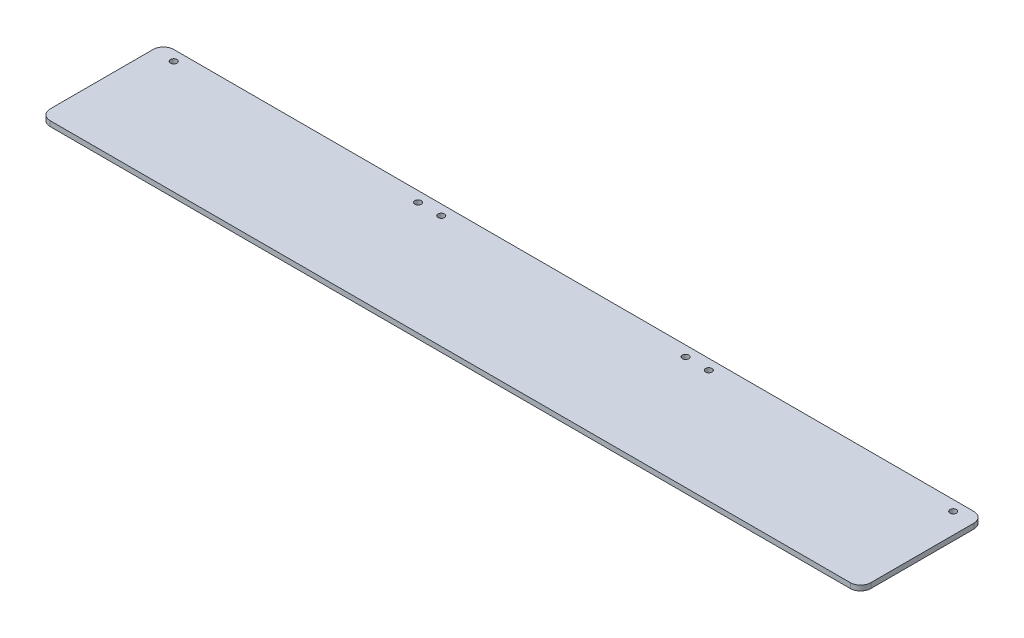
ISO-10303-21;
HEADER;
FILE_DESCRIPTION(('STEP AP214'),'2;1');
FILE_NAME('part.step','',(''),(''),'','','');
FILE_SCHEMA(('AUTOMOTIVE_DESIGN { 1 0 10303 214 1 1 1 1 }'));
ENDSEC;
DATA;
#1=APPLICATION_CONTEXT('core data for automotive mechanical design processes');
#2=APPLICATION_PROTOCOL_DEFINITION('international standard','automotive_design',2000,#1);
#3=PRODUCT_CONTEXT('',#1,'mechanical');
#4=PRODUCT('Part','Part','',(#3));
#5=PRODUCT_RELATED_PRODUCT_CATEGORY('part','',(#4));
#6=PRODUCT_DEFINITION_FORMATION('','',#4);
#7=PRODUCT_DEFINITION_CONTEXT('part definition',#1,'design');
#8=PRODUCT_DEFINITION('design','',#6,#7);
#9=PRODUCT_DEFINITION_SHAPE('','',#8);
#10=(LENGTH_UNIT() NAMED_UNIT(*) SI_UNIT(.MILLI.,.METRE.));
#11=(NAMED_UNIT(*) PLANE_ANGLE_UNIT() SI_UNIT($,.RADIAN.));
#12=(NAMED_UNIT(*) SI_UNIT($,.STERADIAN.) SOLID_ANGLE_UNIT());
#13=UNCERTAINTY_MEASURE_WITH_UNIT(LENGTH_MEASURE(1.E-05),#10,'distance_accuracy_value','');
#14=(GEOMETRIC_REPRESENTATION_CONTEXT(3) GLOBAL_UNCERTAINTY_ASSIGNED_CONTEXT((#13)) GLOBAL_UNIT_ASSIGNED_CONTEXT((#10,
#11,#12)) REPRESENTATION_CONTEXT('',''));
#15=CARTESIAN_POINT('',(0.,0.,0.));
#16=DIRECTION('',(0.,0.,1.));
#17=DIRECTION('',(1.,0.,0.));
#18=AXIS2_PLACEMENT_3D('',#15,#16,#17);
#19=CARTESIAN_POINT('',(2000.25000000001,12.7,-25.4));
#20=DIRECTION('',(0.,-1.,0.));
#21=DIRECTION('',(0.,0.,-1.));
#22=AXIS2_PLACEMENT_3D('',#19,#20,#21);
#23=PLANE('',#22);
#24=CARTESIAN_POINT('',(2000.25000000001,12.7,-25.4));
#25=DIRECTION('',(0.,1.,0.));
#26=DIRECTION('',(0.,0.,-1.));
#27=AXIS2_PLACEMENT_3D('',#24,#25,#26);
#28=CIRCLE('',#27,25.3999999999999);
#29=CARTESIAN_POINT('',(2000.25000000001,12.7,0.));
#30=VERTEX_POINT('',#29);
#31=CARTESIAN_POINT('',(2025.65000000001,12.7,-25.4));
#32=VERTEX_POINT('',#31);
#33=EDGE_CURVE('E149',#30,#32,#28,.T.);
#34=ORIENTED_EDGE('',*,*,#33,.T.);
#35=DIRECTION('',(0.,0.,-1.));
#36=VECTOR('',#35,1.);
#37=CARTESIAN_POINT('',(2025.65000000001,12.7,-25.4));
#38=LINE('',#37,#36);
#39=CARTESIAN_POINT('',(2025.65000000001,12.7,-279.4));
#40=VERTEX_POINT('',#39);
#41=EDGE_CURVE('E97',#32,#40,#38,.T.);
#42=ORIENTED_EDGE('',*,*,#41,.T.);
#43=CARTESIAN_POINT('',(2000.25000000001,12.7,-279.4));
#44=DIRECTION('',(0.,1.,0.));
#45=DIRECTION('',(0.,0.,-1.));
#46=AXIS2_PLACEMENT_3D('',#43,#44,#45);
#47=CIRCLE('',#46,25.3999999999999);
#48=CARTESIAN_POINT('',(2000.25000000001,12.7,-304.8));
#49=VERTEX_POINT('',#48);
#50=EDGE_CURVE('E164',#40,#49,#47,.T.);
#51=ORIENTED_EDGE('',*,*,#50,.T.);
#52=DIRECTION('',(-1.,0.,0.));
#53=VECTOR('',#52,1.);
#54=CARTESIAN_POINT('',(25.3999999999996,12.7,-304.800000000007));
#55=LINE('',#54,#53);
#56=CARTESIAN_POINT('',(25.3999999999996,12.7,-304.800000000007));
#57=VERTEX_POINT('',#56);
#58=EDGE_CURVE('E177',#49,#57,#55,.T.);
#59=ORIENTED_EDGE('',*,*,#58,.T.);
#60=CARTESIAN_POINT('',(25.4,12.7,-279.40000000002));
#61=DIRECTION('',(0.,1.,0.));
#62=DIRECTION('',(0.,0.,-1.));
#63=AXIS2_PLACEMENT_3D('',#60,#61,#62);
#64=CIRCLE('',#63,25.3999999999933);
#65=CARTESIAN_POINT('',(6.6717464886068E-12,12.7,-279.400000000007));
#66=VERTEX_POINT('',#65);
#67=EDGE_CURVE('E116',#57,#66,#64,.T.);
#68=ORIENTED_EDGE('',*,*,#67,.T.);
#69=DIRECTION('',(0.,0.,1.));
#70=VECTOR('',#69,1.);
#71=CARTESIAN_POINT('',(0.,12.7,-25.4000000000002));
#72=LINE('',#71,#70);
#73=CARTESIAN_POINT('',(0.,12.7,-25.4000000000002));
#74=VERTEX_POINT('',#73);
#75=EDGE_CURVE('E110',#66,#74,#72,.T.);
#76=ORIENTED_EDGE('',*,*,#75,.T.);
#77=CARTESIAN_POINT('',(25.4,12.7,-25.4));
#78=DIRECTION('',(0.,1.,0.));
#79=DIRECTION('',(0.,0.,1.));
#80=AXIS2_PLACEMENT_3D('',#77,#78,#79);
#81=CIRCLE('',#80,25.4);
#82=CARTESIAN_POINT('',(25.4,12.7,0.));
#83=VERTEX_POINT('',#82);
#84=EDGE_CURVE('E114',#74,#83,#81,.T.);
#85=ORIENTED_EDGE('',*,*,#84,.T.);
#86=DIRECTION('',(1.,0.,0.));
#87=VECTOR('',#86,1.);
#88=CARTESIAN_POINT('',(25.4000000000002,12.7,0.));
#89=LINE('',#88,#87);
#90=EDGE_CURVE('E54',#83,#30,#89,.T.);
#91=ORIENTED_EDGE('',*,*,#90,.T.);
#92=EDGE_LOOP('',(#34,#42,#51,#59,#68,#76,#85,#91));
#93=FACE_BOUND('',#92,.T.);
#94=CARTESIAN_POINT('',(50.8,12.7,-279.400000000007));
#95=DIRECTION('',(0.,1.,0.));
#96=DIRECTION('',(0.,0.,1.));
#97=AXIS2_PLACEMENT_3D('',#94,#95,#96);
#98=CIRCLE('',#97,7.93749999999794);
#99=CARTESIAN_POINT('',(50.8,12.7,-271.462500000009));
#100=VERTEX_POINT('',#99);
#101=EDGE_CURVE('E138',#100,#100,#98,.T.);
#102=ORIENTED_EDGE('',*,*,#101,.F.);
#103=EDGE_LOOP('',(#102));
#104=FACE_BOUND('',#103,.T.);
#105=CARTESIAN_POINT('',(654.05,12.7,-279.399999999999));
#106=DIRECTION('',(0.,1.,0.));
#107=DIRECTION('',(0.,0.,1.));
#108=AXIS2_PLACEMENT_3D('',#105,#106,#107);
#109=CIRCLE('',#108,7.93750000000026);
#110=CARTESIAN_POINT('',(654.05,12.7,-271.462499999999));
#111=VERTEX_POINT('',#110);
#112=EDGE_CURVE('E186',#111,#111,#109,.T.);
#113=ORIENTED_EDGE('',*,*,#112,.F.);
#114=EDGE_LOOP('',(#113));
#115=FACE_BOUND('',#114,.T.);
#116=CARTESIAN_POINT('',(711.2,12.7,-279.4));
#117=DIRECTION('',(0.,1.,0.));
#118=DIRECTION('',(0.,0.,1.));
#119=AXIS2_PLACEMENT_3D('',#116,#117,#118);
#120=CIRCLE('',#119,7.93750000000026);
#121=CARTESIAN_POINT('',(711.2,12.7,-271.4625));
#122=VERTEX_POINT('',#121);
#123=EDGE_CURVE('E192',#122,#122,#120,.T.);
#124=ORIENTED_EDGE('',*,*,#123,.F.);
#125=EDGE_LOOP('',(#124));
#126=FACE_BOUND('',#125,.T.);
#127=CARTESIAN_POINT('',(1314.45000000001,12.7,-279.400000000001));
#128=DIRECTION('',(0.,1.,0.));
#129=DIRECTION('',(0.,0.,-1.));
#130=AXIS2_PLACEMENT_3D('',#127,#128,#129);
#131=CIRCLE('',#130,7.93750000000044);
#132=CARTESIAN_POINT('',(1314.45000000001,12.7,-287.337500000001));
#133=VERTEX_POINT('',#132);
#134=EDGE_CURVE('E198',#133,#133,#131,.T.);
#135=ORIENTED_EDGE('',*,*,#134,.F.);
#136=EDGE_LOOP('',(#135));
#137=FACE_BOUND('',#136,.T.);
#138=CARTESIAN_POINT('',(1371.60000000001,12.7,-279.4));
#139=DIRECTION('',(0.,1.,0.));
#140=DIRECTION('',(0.,0.,-1.));
#141=AXIS2_PLACEMENT_3D('',#138,#139,#140);
#142=CIRCLE('',#141,7.93750000000089);
#143=CARTESIAN_POINT('',(1371.60000000001,12.7,-287.337500000001));
#144=VERTEX_POINT('',#143);
#145=EDGE_CURVE('E204',#144,#144,#142,.T.);
#146=ORIENTED_EDGE('',*,*,#145,.F.);
#147=EDGE_LOOP('',(#146));
#148=FACE_BOUND('',#147,.T.);
#149=CARTESIAN_POINT('',(1974.85000000001,12.7,-279.4));
#150=DIRECTION('',(0.,1.,0.));
#151=DIRECTION('',(0.,0.,-1.));
#152=AXIS2_PLACEMENT_3D('',#149,#150,#151);
#153=CIRCLE('',#152,7.93749999999998);
#154=CARTESIAN_POINT('',(1974.85000000001,12.7,-287.3375));
#155=VERTEX_POINT('',#154);
#156=EDGE_CURVE('E210',#155,#155,#153,.T.);
#157=ORIENTED_EDGE('',*,*,#156,.F.);
#158=EDGE_LOOP('',(#157));
#159=FACE_BOUND('',#158,.T.);
#160=ADVANCED_FACE('F37',(#93,#104,#115,#126,#137,#148,#159),#23,.F.);
#161=CARTESIAN_POINT('',(2000.25000000001,0.,-25.4));
#162=DIRECTION('',(0.,-1.,0.));
#163=DIRECTION('',(0.,0.,-1.));
#164=AXIS2_PLACEMENT_3D('',#161,#162,#163);
#165=PLANE('',#164);
#166=CARTESIAN_POINT('',(1371.60000000001,0.,-279.4));
#167=DIRECTION('',(0.,1.,0.));
#168=DIRECTION('',(0.,0.,-1.));
#169=AXIS2_PLACEMENT_3D('',#166,#167,#168);
#170=CIRCLE('',#169,7.93750000000089);
#171=CARTESIAN_POINT('',(1371.60000000001,0.,-287.337500000001));
#172=VERTEX_POINT('',#171);
#173=EDGE_CURVE('E207',#172,#172,#170,.T.);
#174=ORIENTED_EDGE('',*,*,#173,.T.);
#175=EDGE_LOOP('',(#174));
#176=FACE_BOUND('',#175,.T.);
#177=CARTESIAN_POINT('',(711.2,0.,-279.4));
#178=DIRECTION('',(0.,1.,0.));
#179=DIRECTION('',(0.,0.,1.));
#180=AXIS2_PLACEMENT_3D('',#177,#178,#179);
#181=CIRCLE('',#180,7.93750000000026);
#182=CARTESIAN_POINT('',(711.2,0.,-271.4625));
#183=VERTEX_POINT('',#182);
#184=EDGE_CURVE('E195',#183,#183,#181,.T.);
#185=ORIENTED_EDGE('',*,*,#184,.T.);
#186=EDGE_LOOP('',(#185));
#187=FACE_BOUND('',#186,.T.);
#188=CARTESIAN_POINT('',(50.8,0.,-279.400000000007));
#189=DIRECTION('',(0.,1.,0.));
#190=DIRECTION('',(0.,0.,1.));
#191=AXIS2_PLACEMENT_3D('',#188,#189,#190);
#192=CIRCLE('',#191,7.93749999999794);
#193=CARTESIAN_POINT('',(50.8,0.,-271.462500000009));
#194=VERTEX_POINT('',#193);
#195=EDGE_CURVE('E183',#194,#194,#192,.T.);
#196=ORIENTED_EDGE('',*,*,#195,.T.);
#197=EDGE_LOOP('',(#196));
#198=FACE_BOUND('',#197,.T.);
#199=CARTESIAN_POINT('',(2000.25000000001,0.,-25.4));
#200=DIRECTION('',(0.,1.,0.));
#201=DIRECTION('',(0.,0.,-1.));
#202=AXIS2_PLACEMENT_3D('',#199,#200,#201);
#203=CIRCLE('',#202,25.3999999999999);
#204=CARTESIAN_POINT('',(2000.25000000001,0.,0.));
#205=VERTEX_POINT('',#204);
#206=CARTESIAN_POINT('',(2025.65000000001,0.,-25.4));
#207=VERTEX_POINT('',#206);
#208=EDGE_CURVE('E134',#205,#207,#203,.T.);
#209=ORIENTED_EDGE('',*,*,#208,.F.);
#210=DIRECTION('',(1.,0.,0.));
#211=VECTOR('',#210,1.);
#212=CARTESIAN_POINT('',(25.4000000000002,0.,0.));
#213=LINE('',#212,#211);
#214=CARTESIAN_POINT('',(25.4,0.,0.));
#215=VERTEX_POINT('',#214);
#216=EDGE_CURVE('E89',#215,#205,#213,.T.);
#217=ORIENTED_EDGE('',*,*,#216,.F.);
#218=CARTESIAN_POINT('',(25.4,0.,-25.4));
#219=DIRECTION('',(0.,1.,0.));
#220=DIRECTION('',(0.,0.,1.));
#221=AXIS2_PLACEMENT_3D('',#218,#219,#220);
#222=CIRCLE('',#221,25.4);
#223=CARTESIAN_POINT('',(0.,0.,-25.4000000000002));
#224=VERTEX_POINT('',#223);
#225=EDGE_CURVE('E83',#224,#215,#222,.T.);
#226=ORIENTED_EDGE('',*,*,#225,.F.);
#227=DIRECTION('',(0.,0.,1.));
#228=VECTOR('',#227,1.);
#229=CARTESIAN_POINT('',(0.,0.,-25.4000000000002));
#230=LINE('',#229,#228);
#231=CARTESIAN_POINT('',(6.6717464886068E-12,0.,-279.400000000007));
#232=VERTEX_POINT('',#231);
#233=EDGE_CURVE('E124',#232,#224,#230,.T.);
#234=ORIENTED_EDGE('',*,*,#233,.F.);
#235=CARTESIAN_POINT('',(25.4,0.,-279.40000000002));
#236=DIRECTION('',(0.,1.,0.));
#237=DIRECTION('',(0.,0.,-1.));
#238=AXIS2_PLACEMENT_3D('',#235,#236,#237);
#239=CIRCLE('',#238,25.3999999999933);
#240=CARTESIAN_POINT('',(25.3999999999996,0.,-304.800000000007));
#241=VERTEX_POINT('',#240);
#242=EDGE_CURVE('E144',#241,#232,#239,.T.);
#243=ORIENTED_EDGE('',*,*,#242,.F.);
#244=DIRECTION('',(-1.,0.,0.));
#245=VECTOR('',#244,1.);
#246=CARTESIAN_POINT('',(25.3999999999996,0.,-304.800000000007));
#247=LINE('',#246,#245);
#248=CARTESIAN_POINT('',(2000.25000000001,0.,-304.8));
#249=VERTEX_POINT('',#248);
#250=EDGE_CURVE('E142',#249,#241,#247,.T.);
#251=ORIENTED_EDGE('',*,*,#250,.F.);
#252=CARTESIAN_POINT('',(2000.25000000001,0.,-279.4));
#253=DIRECTION('',(0.,1.,0.));
#254=DIRECTION('',(0.,0.,-1.));
#255=AXIS2_PLACEMENT_3D('',#252,#253,#254);
#256=CIRCLE('',#255,25.3999999999999);
#257=CARTESIAN_POINT('',(2025.65000000001,0.,-279.4));
#258=VERTEX_POINT('',#257);
#259=EDGE_CURVE('E140',#258,#249,#256,.T.);
#260=ORIENTED_EDGE('',*,*,#259,.F.);
#261=DIRECTION('',(0.,0.,-1.));
#262=VECTOR('',#261,1.);
#263=CARTESIAN_POINT('',(2025.65000000001,0.,-25.4));
#264=LINE('',#263,#262);
#265=EDGE_CURVE('E137',#207,#258,#264,.T.);
#266=ORIENTED_EDGE('',*,*,#265,.F.);
#267=EDGE_LOOP('',(#209,#217,#226,#234,#243,#251,#260,#266));
#268=FACE_BOUND('',#267,.T.);
#269=CARTESIAN_POINT('',(654.05,0.,-279.399999999999));
#270=DIRECTION('',(0.,1.,0.));
#271=DIRECTION('',(0.,0.,1.));
#272=AXIS2_PLACEMENT_3D('',#269,#270,#271);
#273=CIRCLE('',#272,7.93750000000026);
#274=CARTESIAN_POINT('',(654.05,0.,-271.462499999999));
#275=VERTEX_POINT('',#274);
#276=EDGE_CURVE('E189',#275,#275,#273,.T.);
#277=ORIENTED_EDGE('',*,*,#276,.T.);
#278=EDGE_LOOP('',(#277));
#279=FACE_BOUND('',#278,.T.);
#280=CARTESIAN_POINT('',(1314.45000000001,0.,-279.400000000001));
#281=DIRECTION('',(0.,1.,0.));
#282=DIRECTION('',(0.,0.,-1.));
#283=AXIS2_PLACEMENT_3D('',#280,#281,#282);
#284=CIRCLE('',#283,7.93750000000044);
#285=CARTESIAN_POINT('',(1314.45000000001,0.,-287.337500000001));
#286=VERTEX_POINT('',#285);
#287=EDGE_CURVE('E201',#286,#286,#284,.T.);
#288=ORIENTED_EDGE('',*,*,#287,.T.);
#289=EDGE_LOOP('',(#288));
#290=FACE_BOUND('',#289,.T.);
#291=CARTESIAN_POINT('',(1974.85000000001,0.,-279.4));
#292=DIRECTION('',(0.,1.,0.));
#293=DIRECTION('',(0.,0.,-1.));
#294=AXIS2_PLACEMENT_3D('',#291,#292,#293);
#295=CIRCLE('',#294,7.93749999999998);
#296=CARTESIAN_POINT('',(1974.85000000001,0.,-287.3375));
#297=VERTEX_POINT('',#296);
#298=EDGE_CURVE('E213',#297,#297,#295,.T.);
#299=ORIENTED_EDGE('',*,*,#298,.T.);
#300=EDGE_LOOP('',(#299));
#301=FACE_BOUND('',#300,.T.);
#302=ADVANCED_FACE('F168',(#176,#187,#198,#268,#279,#290,#301),#165,.T.);
#303=CARTESIAN_POINT('',(2000.25000000001,12.7,-25.4));
#304=DIRECTION('',(0.,-1.,0.));
#305=DIRECTION('',(0.,0.,-1.));
#306=AXIS2_PLACEMENT_3D('',#303,#304,#305);
#307=CYLINDRICAL_SURFACE('',#306,25.3999999999999);
#308=ORIENTED_EDGE('',*,*,#208,.T.);
#309=DIRECTION('',(0.,-1.,0.));
#310=VECTOR('',#309,1.);
#311=CARTESIAN_POINT('',(2025.65000000001,12.7,-25.4));
#312=LINE('',#311,#310);
#313=EDGE_CURVE('E11',#32,#207,#312,.T.);
#314=ORIENTED_EDGE('',*,*,#313,.F.);
#315=ORIENTED_EDGE('',*,*,#33,.F.);
#316=DIRECTION('',(0.,-1.,0.));
#317=VECTOR('',#316,1.);
#318=CARTESIAN_POINT('',(2000.25000000001,12.7,0.));
#319=LINE('',#318,#317);
#320=EDGE_CURVE('E130',#30,#205,#319,.T.);
#321=ORIENTED_EDGE('',*,*,#320,.T.);
#322=EDGE_LOOP('',(#308,#314,#315,#321));
#323=FACE_BOUND('',#322,.T.);
#324=ADVANCED_FACE('F39',(#323),#307,.T.);
#325=CARTESIAN_POINT('',(2025.65000000001,12.7,-25.4));
#326=DIRECTION('',(-1.,0.,0.));
#327=DIRECTION('',(0.,0.,1.));
#328=AXIS2_PLACEMENT_3D('',#325,#326,#327);
#329=PLANE('',#328);
#330=ORIENTED_EDGE('',*,*,#265,.T.);
#331=DIRECTION('',(0.,-1.,0.));
#332=VECTOR('',#331,1.);
#333=CARTESIAN_POINT('',(2025.65000000001,12.7,-279.4));
#334=LINE('',#333,#332);
#335=EDGE_CURVE('E46',#40,#258,#334,.T.);
#336=ORIENTED_EDGE('',*,*,#335,.F.);
#337=ORIENTED_EDGE('',*,*,#41,.F.);
#338=ORIENTED_EDGE('',*,*,#313,.T.);
#339=EDGE_LOOP('',(#330,#336,#337,#338));
#340=FACE_BOUND('',#339,.T.);
#341=ADVANCED_FACE('F245',(#340),#329,.F.);
#342=CARTESIAN_POINT('',(2000.25000000001,12.7,-279.4));
#343=DIRECTION('',(0.,-1.,0.));
#344=DIRECTION('',(0.,0.,-1.));
#345=AXIS2_PLACEMENT_3D('',#342,#343,#344);
#346=CYLINDRICAL_SURFACE('',#345,25.3999999999999);
#347=ORIENTED_EDGE('',*,*,#259,.T.);
#348=DIRECTION('',(0.,-1.,0.));
#349=VECTOR('',#348,1.);
#350=CARTESIAN_POINT('',(2000.25000000001,12.7,-304.8));
#351=LINE('',#350,#349);
#352=EDGE_CURVE('E156',#49,#249,#351,.T.);
#353=ORIENTED_EDGE('',*,*,#352,.F.);
#354=ORIENTED_EDGE('',*,*,#50,.F.);
#355=ORIENTED_EDGE('',*,*,#335,.T.);
#356=EDGE_LOOP('',(#347,#353,#354,#355));
#357=FACE_BOUND('',#356,.T.);
#358=ADVANCED_FACE('F162',(#357),#346,.T.);
#359=CARTESIAN_POINT('',(25.3999999999996,12.7,-304.800000000007));
#360=DIRECTION('',(0.,0.,1.));
#361=DIRECTION('',(1.,0.,0.));
#362=AXIS2_PLACEMENT_3D('',#359,#360,#361);
#363=PLANE('',#362);
#364=ORIENTED_EDGE('',*,*,#250,.T.);
#365=DIRECTION('',(0.,-1.,0.));
#366=VECTOR('',#365,1.);
#367=CARTESIAN_POINT('',(25.3999999999996,12.7,-304.800000000007));
#368=LINE('',#367,#366);
#369=EDGE_CURVE('E153',#57,#241,#368,.T.);
#370=ORIENTED_EDGE('',*,*,#369,.F.);
#371=ORIENTED_EDGE('',*,*,#58,.F.);
#372=ORIENTED_EDGE('',*,*,#352,.T.);
#373=EDGE_LOOP('',(#364,#370,#371,#372));
#374=FACE_BOUND('',#373,.T.);
#375=ADVANCED_FACE('F173',(#374),#363,.F.);
#376=CARTESIAN_POINT('',(25.4,12.7,-279.40000000002));
#377=DIRECTION('',(0.,-1.,0.));
#378=DIRECTION('',(0.,0.,-1.));
#379=AXIS2_PLACEMENT_3D('',#376,#377,#378);
#380=CYLINDRICAL_SURFACE('',#379,25.3999999999933);
#381=ORIENTED_EDGE('',*,*,#242,.T.);
#382=DIRECTION('',(0.,-1.,0.));
#383=VECTOR('',#382,1.);
#384=CARTESIAN_POINT('',(6.6717464886068E-12,12.7,-279.400000000007));
#385=LINE('',#384,#383);
#386=EDGE_CURVE('E125',#66,#232,#385,.T.);
#387=ORIENTED_EDGE('',*,*,#386,.F.);
#388=ORIENTED_EDGE('',*,*,#67,.F.);
#389=ORIENTED_EDGE('',*,*,#369,.T.);
#390=EDGE_LOOP('',(#381,#387,#388,#389));
#391=FACE_BOUND('',#390,.T.);
#392=ADVANCED_FACE('F176',(#391),#380,.T.);
#393=CARTESIAN_POINT('',(0.,12.7,-25.4000000000002));
#394=DIRECTION('',(1.,0.,0.));
#395=DIRECTION('',(0.,0.,-1.));
#396=AXIS2_PLACEMENT_3D('',#393,#394,#395);
#397=PLANE('',#396);
#398=ORIENTED_EDGE('',*,*,#233,.T.);
#399=DIRECTION('',(0.,-1.,0.));
#400=VECTOR('',#399,1.);
#401=CARTESIAN_POINT('',(0.,12.7,-25.4000000000002));
#402=LINE('',#401,#400);
#403=EDGE_CURVE('E121',#74,#224,#402,.T.);
#404=ORIENTED_EDGE('',*,*,#403,.F.);
#405=ORIENTED_EDGE('',*,*,#75,.F.);
#406=ORIENTED_EDGE('',*,*,#386,.T.);
#407=EDGE_LOOP('',(#398,#404,#405,#406));
#408=FACE_BOUND('',#407,.T.);
#409=ADVANCED_FACE('F122',(#408),#397,.F.);
#410=CARTESIAN_POINT('',(25.4,12.7,-25.4));
#411=DIRECTION('',(0.,-1.,0.));
#412=DIRECTION('',(0.,0.,-1.));
#413=AXIS2_PLACEMENT_3D('',#410,#411,#412);
#414=CYLINDRICAL_SURFACE('',#413,25.4);
#415=ORIENTED_EDGE('',*,*,#225,.T.);
#416=DIRECTION('',(0.,-1.,0.));
#417=VECTOR('',#416,1.);
#418=CARTESIAN_POINT('',(25.4,12.7,0.));
#419=LINE('',#418,#417);
#420=EDGE_CURVE('E126',#83,#215,#419,.T.);
#421=ORIENTED_EDGE('',*,*,#420,.F.);
#422=ORIENTED_EDGE('',*,*,#84,.F.);
#423=ORIENTED_EDGE('',*,*,#403,.T.);
#424=EDGE_LOOP('',(#415,#421,#422,#423));
#425=FACE_BOUND('',#424,.T.);
#426=ADVANCED_FACE('F128',(#425),#414,.T.);
#427=CARTESIAN_POINT('',(25.4000000000002,12.7,0.));
#428=DIRECTION('',(0.,0.,-1.));
#429=DIRECTION('',(-1.,0.,0.));
#430=AXIS2_PLACEMENT_3D('',#427,#428,#429);
#431=PLANE('',#430);
#432=ORIENTED_EDGE('',*,*,#216,.T.);
#433=ORIENTED_EDGE('',*,*,#320,.F.);
#434=ORIENTED_EDGE('',*,*,#90,.F.);
#435=ORIENTED_EDGE('',*,*,#420,.T.);
#436=EDGE_LOOP('',(#432,#433,#434,#435));
#437=FACE_BOUND('',#436,.T.);
#438=ADVANCED_FACE('F233',(#437),#431,.F.);
#439=CARTESIAN_POINT('',(50.8,12.7,-279.400000000007));
#440=DIRECTION('',(0.,-1.,0.));
#441=DIRECTION('',(0.,0.,-1.));
#442=AXIS2_PLACEMENT_3D('',#439,#440,#441);
#443=CYLINDRICAL_SURFACE('',#442,7.93749999999794);
#444=ORIENTED_EDGE('',*,*,#101,.T.);
#445=EDGE_LOOP('',(#444));
#446=FACE_BOUND('',#445,.T.);
#447=ORIENTED_EDGE('',*,*,#195,.F.);
#448=EDGE_LOOP('',(#447));
#449=FACE_BOUND('',#448,.T.);
#450=ADVANCED_FACE('F230',(#446,#449),#443,.F.);
#451=CARTESIAN_POINT('',(654.05,12.7,-279.399999999999));
#452=DIRECTION('',(0.,-1.,0.));
#453=DIRECTION('',(0.,0.,-1.));
#454=AXIS2_PLACEMENT_3D('',#451,#452,#453);
#455=CYLINDRICAL_SURFACE('',#454,7.93750000000026);
#456=ORIENTED_EDGE('',*,*,#112,.T.);
#457=EDGE_LOOP('',(#456));
#458=FACE_BOUND('',#457,.T.);
#459=ORIENTED_EDGE('',*,*,#276,.F.);
#460=EDGE_LOOP('',(#459));
#461=FACE_BOUND('',#460,.T.);
#462=ADVANCED_FACE('F294',(#458,#461),#455,.F.);
#463=CARTESIAN_POINT('',(711.2,12.7,-279.4));
#464=DIRECTION('',(0.,-1.,0.));
#465=DIRECTION('',(0.,0.,-1.));
#466=AXIS2_PLACEMENT_3D('',#463,#464,#465);
#467=CYLINDRICAL_SURFACE('',#466,7.93750000000026);
#468=ORIENTED_EDGE('',*,*,#123,.T.);
#469=EDGE_LOOP('',(#468));
#470=FACE_BOUND('',#469,.T.);
#471=ORIENTED_EDGE('',*,*,#184,.F.);
#472=EDGE_LOOP('',(#471));
#473=FACE_BOUND('',#472,.T.);
#474=ADVANCED_FACE('F301',(#470,#473),#467,.F.);
#475=CARTESIAN_POINT('',(1314.45000000001,12.7,-279.400000000001));
#476=DIRECTION('',(0.,-1.,0.));
#477=DIRECTION('',(0.,0.,-1.));
#478=AXIS2_PLACEMENT_3D('',#475,#476,#477);
#479=CYLINDRICAL_SURFACE('',#478,7.93750000000044);
#480=ORIENTED_EDGE('',*,*,#134,.T.);
#481=EDGE_LOOP('',(#480));
#482=FACE_BOUND('',#481,.T.);
#483=ORIENTED_EDGE('',*,*,#287,.F.);
#484=EDGE_LOOP('',(#483));
#485=FACE_BOUND('',#484,.T.);
#486=ADVANCED_FACE('F308',(#482,#485),#479,.F.);
#487=CARTESIAN_POINT('',(1371.60000000001,12.7,-279.4));
#488=DIRECTION('',(0.,-1.,0.));
#489=DIRECTION('',(0.,0.,-1.));
#490=AXIS2_PLACEMENT_3D('',#487,#488,#489);
#491=CYLINDRICAL_SURFACE('',#490,7.93750000000089);
#492=ORIENTED_EDGE('',*,*,#145,.T.);
#493=EDGE_LOOP('',(#492));
#494=FACE_BOUND('',#493,.T.);
#495=ORIENTED_EDGE('',*,*,#173,.F.);
#496=EDGE_LOOP('',(#495));
#497=FACE_BOUND('',#496,.T.);
#498=ADVANCED_FACE('F316',(#494,#497),#491,.F.);
#499=CARTESIAN_POINT('',(1974.85000000001,12.7,-279.4));
#500=DIRECTION('',(0.,-1.,0.));
#501=DIRECTION('',(0.,0.,-1.));
#502=AXIS2_PLACEMENT_3D('',#499,#500,#501);
#503=CYLINDRICAL_SURFACE('',#502,7.93749999999998);
#504=ORIENTED_EDGE('',*,*,#156,.T.);
#505=EDGE_LOOP('',(#504));
#506=FACE_BOUND('',#505,.T.);
#507=ORIENTED_EDGE('',*,*,#298,.F.);
#508=EDGE_LOOP('',(#507));
#509=FACE_BOUND('',#508,.T.);
#510=ADVANCED_FACE('F219',(#506,#509),#503,.F.);
#511=CLOSED_SHELL('',(#160,#302,#324,#341,#358,#375,#392,#409,#426,#438,#450,#462,#474,#486,
#498,#510));
#512=MANIFOLD_SOLID_BREP('B2',#511);
#513=ADVANCED_BREP_SHAPE_REPRESENTATION('',(#18,#512),#14);
#514=SHAPE_DEFINITION_REPRESENTATION(#9,#513);
ENDSEC;
END-ISO-10303-21;
